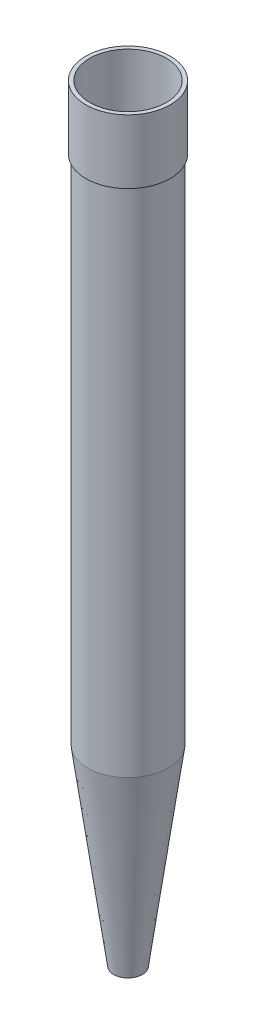
ISO-10303-21;
HEADER;
FILE_DESCRIPTION(('STEP AP214'),'2;1');
FILE_NAME('part.step','',(''),(''),'','','');
FILE_SCHEMA(('AUTOMOTIVE_DESIGN { 1 0 10303 214 1 1 1 1 }'));
ENDSEC;
DATA;
#1=APPLICATION_CONTEXT('core data for automotive mechanical design processes');
#2=APPLICATION_PROTOCOL_DEFINITION('international standard','automotive_design',2000,#1);
#3=PRODUCT_CONTEXT('',#1,'mechanical');
#4=PRODUCT('Part','Part','',(#3));
#5=PRODUCT_RELATED_PRODUCT_CATEGORY('part','',(#4));
#6=PRODUCT_DEFINITION_FORMATION('','',#4);
#7=PRODUCT_DEFINITION_CONTEXT('part definition',#1,'design');
#8=PRODUCT_DEFINITION('design','',#6,#7);
#9=PRODUCT_DEFINITION_SHAPE('','',#8);
#10=(LENGTH_UNIT() NAMED_UNIT(*) SI_UNIT(.MILLI.,.METRE.));
#11=(NAMED_UNIT(*) PLANE_ANGLE_UNIT() SI_UNIT($,.RADIAN.));
#12=(NAMED_UNIT(*) SI_UNIT($,.STERADIAN.) SOLID_ANGLE_UNIT());
#13=UNCERTAINTY_MEASURE_WITH_UNIT(LENGTH_MEASURE(1.E-05),#10,'distance_accuracy_value','');
#14=(GEOMETRIC_REPRESENTATION_CONTEXT(3) GLOBAL_UNCERTAINTY_ASSIGNED_CONTEXT((#13)) GLOBAL_UNIT_ASSIGNED_CONTEXT((#10,
#11,#12)) REPRESENTATION_CONTEXT('',''));
#15=CARTESIAN_POINT('',(0.,0.,0.));
#16=DIRECTION('',(0.,0.,1.));
#17=DIRECTION('',(1.,0.,0.));
#18=AXIS2_PLACEMENT_3D('',#15,#16,#17);
#19=CARTESIAN_POINT('',(16.51,0.,0.));
#20=DIRECTION('',(0.,-1.,0.));
#21=DIRECTION('',(0.,0.,-1.));
#22=AXIS2_PLACEMENT_3D('',#19,#20,#21);
#23=PLANE('',#22);
#24=CARTESIAN_POINT('',(0.,0.,0.));
#25=DIRECTION('',(0.,-1.,0.));
#26=DIRECTION('',(0.,0.,-1.));
#27=AXIS2_PLACEMENT_3D('',#24,#25,#26);
#28=CIRCLE('',#27,19.05);
#29=CARTESIAN_POINT('',(0.,0.,-19.05));
#30=VERTEX_POINT('',#29);
#31=EDGE_CURVE('E10',#30,#30,#28,.T.);
#32=ORIENTED_EDGE('',*,*,#31,.T.);
#33=EDGE_LOOP('',(#32));
#34=FACE_BOUND('',#33,.T.);
#35=CARTESIAN_POINT('',(0.,0.,0.));
#36=DIRECTION('',(0.,-1.,0.));
#37=DIRECTION('',(0.,0.,-1.));
#38=AXIS2_PLACEMENT_3D('',#35,#36,#37);
#39=CIRCLE('',#38,16.51);
#40=CARTESIAN_POINT('',(0.,0.,-16.51));
#41=VERTEX_POINT('',#40);
#42=EDGE_CURVE('E74',#41,#41,#39,.T.);
#43=ORIENTED_EDGE('',*,*,#42,.F.);
#44=EDGE_LOOP('',(#43));
#45=FACE_BOUND('',#44,.T.);
#46=ADVANCED_FACE('F39',(#34,#45),#23,.T.);
#47=CARTESIAN_POINT('',(0.,0.,0.));
#48=DIRECTION('',(0.,1.,0.));
#49=DIRECTION('',(0.,0.,1.));
#50=AXIS2_PLACEMENT_3D('',#47,#48,#49);
#51=CONICAL_SURFACE('',#50,19.05,0.134188727952421);
#52=CARTESIAN_POINT('',(0.,254.,0.));
#53=DIRECTION('',(0.,-1.,0.));
#54=DIRECTION('',(0.,0.,-1.));
#55=AXIS2_PLACEMENT_3D('',#52,#53,#54);
#56=CIRCLE('',#55,53.34);
#57=CARTESIAN_POINT('',(0.,254.,-53.34));
#58=VERTEX_POINT('',#57);
#59=EDGE_CURVE('E46',#58,#58,#56,.T.);
#60=ORIENTED_EDGE('',*,*,#59,.T.);
#61=EDGE_LOOP('',(#60));
#62=FACE_BOUND('',#61,.T.);
#63=ORIENTED_EDGE('',*,*,#31,.F.);
#64=EDGE_LOOP('',(#63));
#65=FACE_BOUND('',#64,.T.);
#66=ADVANCED_FACE('F83',(#62,#65),#51,.T.);
#67=CARTESIAN_POINT('',(0.,37.9715372676655,0.));
#68=DIRECTION('',(0.,-1.,0.));
#69=DIRECTION('',(0.,0.,-1.));
#70=AXIS2_PLACEMENT_3D('',#67,#68,#69);
#71=CYLINDRICAL_SURFACE('',#70,53.3399999999999);
#72=CARTESIAN_POINT('',(0.,931.333333333334,0.));
#73=DIRECTION('',(0.,-1.,0.));
#74=DIRECTION('',(0.,0.,-1.));
#75=AXIS2_PLACEMENT_3D('',#72,#73,#74);
#76=CIRCLE('',#75,53.3399999999998);
#77=CARTESIAN_POINT('',(0.,931.333333333334,-53.3399999999998));
#78=VERTEX_POINT('',#77);
#79=EDGE_CURVE('E51',#78,#78,#76,.T.);
#80=ORIENTED_EDGE('',*,*,#79,.T.);
#81=EDGE_LOOP('',(#80));
#82=FACE_BOUND('',#81,.T.);
#83=ORIENTED_EDGE('',*,*,#59,.F.);
#84=EDGE_LOOP('',(#83));
#85=FACE_BOUND('',#84,.T.);
#86=ADVANCED_FACE('F87',(#82,#85),#71,.T.);
#87=CARTESIAN_POINT('',(55.88,931.333333333334,0.));
#88=DIRECTION('',(0.,-1.,0.));
#89=DIRECTION('',(0.,0.,-1.));
#90=AXIS2_PLACEMENT_3D('',#87,#88,#89);
#91=PLANE('',#90);
#92=CARTESIAN_POINT('',(0.,931.333333333334,0.));
#93=DIRECTION('',(0.,-1.,0.));
#94=DIRECTION('',(0.,0.,-1.));
#95=AXIS2_PLACEMENT_3D('',#92,#93,#94);
#96=CIRCLE('',#95,55.88);
#97=CARTESIAN_POINT('',(0.,931.333333333334,-55.88));
#98=VERTEX_POINT('',#97);
#99=EDGE_CURVE('E56',#98,#98,#96,.T.);
#100=ORIENTED_EDGE('',*,*,#99,.T.);
#101=EDGE_LOOP('',(#100));
#102=FACE_BOUND('',#101,.T.);
#103=ORIENTED_EDGE('',*,*,#79,.F.);
#104=EDGE_LOOP('',(#103));
#105=FACE_BOUND('',#104,.T.);
#106=ADVANCED_FACE('F91',(#102,#105),#91,.T.);
#107=CARTESIAN_POINT('',(0.,37.9715372676655,0.));
#108=DIRECTION('',(0.,-1.,0.));
#109=DIRECTION('',(0.,0.,-1.));
#110=AXIS2_PLACEMENT_3D('',#107,#108,#109);
#111=CYLINDRICAL_SURFACE('',#110,55.88);
#112=CARTESIAN_POINT('',(0.,1016.,0.));
#113=DIRECTION('',(0.,-1.,0.));
#114=DIRECTION('',(0.,0.,-1.));
#115=AXIS2_PLACEMENT_3D('',#112,#113,#114);
#116=CIRCLE('',#115,55.88);
#117=CARTESIAN_POINT('',(0.,1016.,-55.88));
#118=VERTEX_POINT('',#117);
#119=EDGE_CURVE('E62',#118,#118,#116,.T.);
#120=ORIENTED_EDGE('',*,*,#119,.T.);
#121=EDGE_LOOP('',(#120));
#122=FACE_BOUND('',#121,.T.);
#123=ORIENTED_EDGE('',*,*,#99,.F.);
#124=EDGE_LOOP('',(#123));
#125=FACE_BOUND('',#124,.T.);
#126=ADVANCED_FACE('F98',(#122,#125),#111,.T.);
#127=CARTESIAN_POINT('',(50.8,1016.,0.));
#128=DIRECTION('',(0.,1.,0.));
#129=DIRECTION('',(0.,0.,1.));
#130=AXIS2_PLACEMENT_3D('',#127,#128,#129);
#131=PLANE('',#130);
#132=CARTESIAN_POINT('',(0.,1016.,0.));
#133=DIRECTION('',(0.,-1.,0.));
#134=DIRECTION('',(0.,0.,-1.));
#135=AXIS2_PLACEMENT_3D('',#132,#133,#134);
#136=CIRCLE('',#135,50.8);
#137=CARTESIAN_POINT('',(0.,1016.,-50.8));
#138=VERTEX_POINT('',#137);
#139=EDGE_CURVE('E66',#138,#138,#136,.T.);
#140=ORIENTED_EDGE('',*,*,#139,.T.);
#141=EDGE_LOOP('',(#140));
#142=FACE_BOUND('',#141,.T.);
#143=ORIENTED_EDGE('',*,*,#119,.F.);
#144=EDGE_LOOP('',(#143));
#145=FACE_BOUND('',#144,.T.);
#146=ADVANCED_FACE('F102',(#142,#145),#131,.T.);
#147=CARTESIAN_POINT('',(0.,37.9715372676655,0.));
#148=DIRECTION('',(0.,-1.,0.));
#149=DIRECTION('',(0.,0.,-1.));
#150=AXIS2_PLACEMENT_3D('',#147,#148,#149);
#151=CYLINDRICAL_SURFACE('',#150,50.8);
#152=CARTESIAN_POINT('',(0.,254.,0.));
#153=DIRECTION('',(0.,-1.,0.));
#154=DIRECTION('',(0.,0.,-1.));
#155=AXIS2_PLACEMENT_3D('',#152,#153,#154);
#156=CIRCLE('',#155,50.8);
#157=CARTESIAN_POINT('',(0.,254.,-50.8));
#158=VERTEX_POINT('',#157);
#159=EDGE_CURVE('E70',#158,#158,#156,.T.);
#160=ORIENTED_EDGE('',*,*,#159,.T.);
#161=EDGE_LOOP('',(#160));
#162=FACE_BOUND('',#161,.T.);
#163=ORIENTED_EDGE('',*,*,#139,.F.);
#164=EDGE_LOOP('',(#163));
#165=FACE_BOUND('',#164,.T.);
#166=ADVANCED_FACE('F106',(#162,#165),#151,.F.);
#167=CARTESIAN_POINT('',(0.,254.,0.));
#168=DIRECTION('',(0.,1.,0.));
#169=DIRECTION('',(0.,0.,1.));
#170=AXIS2_PLACEMENT_3D('',#167,#168,#169);
#171=CONICAL_SURFACE('',#170,50.8,0.134188727952421);
#172=ORIENTED_EDGE('',*,*,#42,.T.);
#173=EDGE_LOOP('',(#172));
#174=FACE_BOUND('',#173,.T.);
#175=ORIENTED_EDGE('',*,*,#159,.F.);
#176=EDGE_LOOP('',(#175));
#177=FACE_BOUND('',#176,.T.);
#178=ADVANCED_FACE('F79',(#174,#177),#171,.F.);
#179=CLOSED_SHELL('',(#46,#66,#86,#106,#126,#146,#166,#178));
#180=MANIFOLD_SOLID_BREP('B2',#179);
#181=ADVANCED_BREP_SHAPE_REPRESENTATION('',(#18,#180),#14);
#182=SHAPE_DEFINITION_REPRESENTATION(#9,#181);
ENDSEC;
END-ISO-10303-21;
